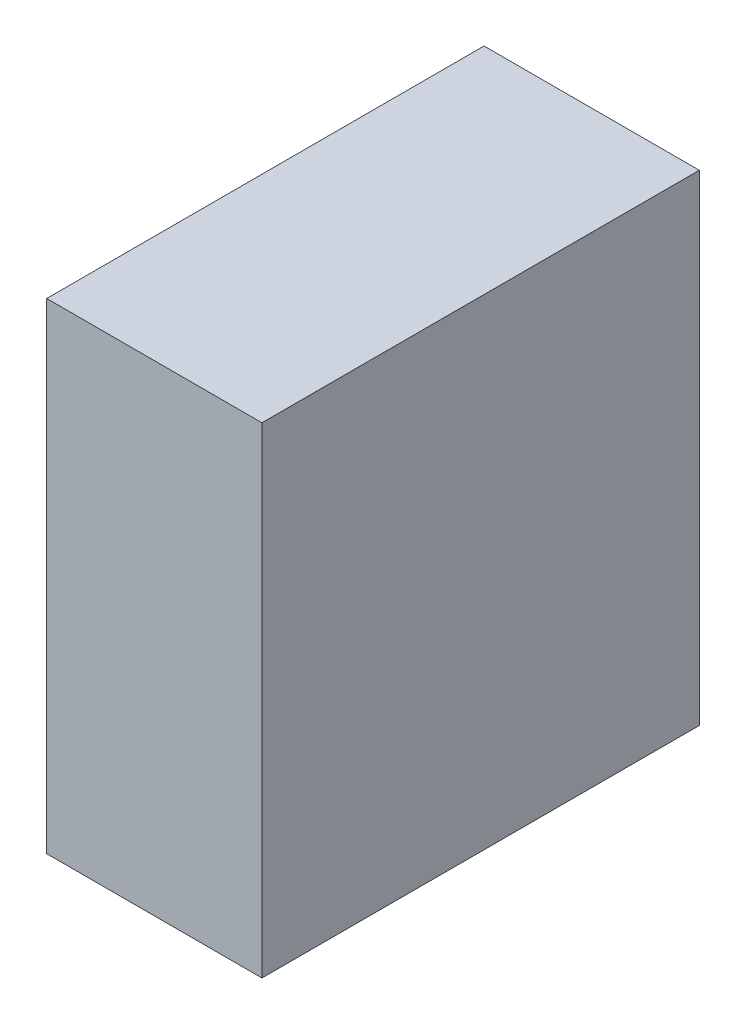
ISO-10303-21;
HEADER;
FILE_DESCRIPTION(('STEP AP214'),'2;1');
FILE_NAME('part.step','',(''),(''),'','','');
FILE_SCHEMA(('AUTOMOTIVE_DESIGN { 1 0 10303 214 1 1 1 1 }'));
ENDSEC;
DATA;
#1=APPLICATION_CONTEXT('core data for automotive mechanical design processes');
#2=APPLICATION_PROTOCOL_DEFINITION('international standard','automotive_design',2000,#1);
#3=PRODUCT_CONTEXT('',#1,'mechanical');
#4=PRODUCT('Part','Part','',(#3));
#5=PRODUCT_RELATED_PRODUCT_CATEGORY('part','',(#4));
#6=PRODUCT_DEFINITION_FORMATION('','',#4);
#7=PRODUCT_DEFINITION_CONTEXT('part definition',#1,'design');
#8=PRODUCT_DEFINITION('design','',#6,#7);
#9=PRODUCT_DEFINITION_SHAPE('','',#8);
#10=(LENGTH_UNIT() NAMED_UNIT(*) SI_UNIT(.MILLI.,.METRE.));
#11=(NAMED_UNIT(*) PLANE_ANGLE_UNIT() SI_UNIT($,.RADIAN.));
#12=(NAMED_UNIT(*) SI_UNIT($,.STERADIAN.) SOLID_ANGLE_UNIT());
#13=UNCERTAINTY_MEASURE_WITH_UNIT(LENGTH_MEASURE(1.E-05),#10,'distance_accuracy_value','');
#14=(GEOMETRIC_REPRESENTATION_CONTEXT(3) GLOBAL_UNCERTAINTY_ASSIGNED_CONTEXT((#13)) GLOBAL_UNIT_ASSIGNED_CONTEXT((#10,
#11,#12)) REPRESENTATION_CONTEXT('',''));
#15=CARTESIAN_POINT('',(0.,0.,0.));
#16=DIRECTION('',(0.,0.,1.));
#17=DIRECTION('',(1.,0.,0.));
#18=AXIS2_PLACEMENT_3D('',#15,#16,#17);
#19=CARTESIAN_POINT('',(-2.35000038,-5.2500022,0.));
#20=DIRECTION('',(-1.,0.,0.));
#21=DIRECTION('',(0.,0.,1.));
#22=AXIS2_PLACEMENT_3D('',#19,#20,#21);
#23=PLANE('',#22);
#24=DIRECTION('',(0.,0.,1.));
#25=VECTOR('',#24,1.);
#26=CARTESIAN_POINT('',(-2.35000038,5.2500022,0.));
#27=LINE('',#26,#25);
#28=CARTESIAN_POINT('',(-2.35000038,5.2500022,0.));
#29=VERTEX_POINT('',#28);
#30=CARTESIAN_POINT('',(-2.35000038,5.2500022,9.54999868));
#31=VERTEX_POINT('',#30);
#32=EDGE_CURVE('E20',#29,#31,#27,.T.);
#33=ORIENTED_EDGE('',*,*,#32,.F.);
#34=DIRECTION('',(0.,1.,0.));
#35=VECTOR('',#34,1.);
#36=CARTESIAN_POINT('',(-2.35000038,5.2500022,0.));
#37=LINE('',#36,#35);
#38=CARTESIAN_POINT('',(-2.35000038,-5.2500022,0.));
#39=VERTEX_POINT('',#38);
#40=EDGE_CURVE('E79',#29,#39,#37,.F.);
#41=ORIENTED_EDGE('',*,*,#40,.T.);
#42=DIRECTION('',(0.,0.,-1.));
#43=VECTOR('',#42,1.);
#44=CARTESIAN_POINT('',(-2.35000038,-5.2500022,0.));
#45=LINE('',#44,#43);
#46=CARTESIAN_POINT('',(-2.35000038,-5.2500022,9.54999868));
#47=VERTEX_POINT('',#46);
#48=EDGE_CURVE('E61',#47,#39,#45,.T.);
#49=ORIENTED_EDGE('',*,*,#48,.F.);
#50=DIRECTION('',(0.,1.,0.));
#51=VECTOR('',#50,1.);
#52=CARTESIAN_POINT('',(-2.35000038,5.2500022,9.54999868));
#53=LINE('',#52,#51);
#54=EDGE_CURVE('E56',#31,#47,#53,.F.);
#55=ORIENTED_EDGE('',*,*,#54,.F.);
#56=EDGE_LOOP('',(#33,#41,#49,#55));
#57=FACE_BOUND('',#56,.T.);
#58=ADVANCED_FACE('F17',(#57),#23,.T.);
#59=CARTESIAN_POINT('',(-2.35000038,5.2500022,0.));
#60=DIRECTION('',(0.,1.,0.));
#61=DIRECTION('',(0.,0.,1.));
#62=AXIS2_PLACEMENT_3D('',#59,#60,#61);
#63=PLANE('',#62);
#64=DIRECTION('',(0.,0.,-1.));
#65=VECTOR('',#64,1.);
#66=CARTESIAN_POINT('',(2.35000038,5.2500022,0.));
#67=LINE('',#66,#65);
#68=CARTESIAN_POINT('',(2.35000038,5.2500022,0.));
#69=VERTEX_POINT('',#68);
#70=CARTESIAN_POINT('',(2.35000038,5.2500022,9.54999868));
#71=VERTEX_POINT('',#70);
#72=EDGE_CURVE('E83',#69,#71,#67,.F.);
#73=ORIENTED_EDGE('',*,*,#72,.F.);
#74=DIRECTION('',(1.,0.,0.));
#75=VECTOR('',#74,1.);
#76=CARTESIAN_POINT('',(-2.35000038,5.2500022,0.));
#77=LINE('',#76,#75);
#78=EDGE_CURVE('E68',#69,#29,#77,.F.);
#79=ORIENTED_EDGE('',*,*,#78,.T.);
#80=ORIENTED_EDGE('',*,*,#32,.T.);
#81=DIRECTION('',(1.,0.,0.));
#82=VECTOR('',#81,1.);
#83=CARTESIAN_POINT('',(-2.35000038,5.2500022,9.54999868));
#84=LINE('',#83,#82);
#85=EDGE_CURVE('E63',#71,#31,#84,.F.);
#86=ORIENTED_EDGE('',*,*,#85,.F.);
#87=EDGE_LOOP('',(#73,#79,#80,#86));
#88=FACE_BOUND('',#87,.T.);
#89=ADVANCED_FACE('F65',(#88),#63,.T.);
#90=CARTESIAN_POINT('',(-2.35000038,5.2500022,9.54999868));
#91=DIRECTION('',(0.,0.,1.));
#92=DIRECTION('',(1.,0.,0.));
#93=AXIS2_PLACEMENT_3D('',#90,#91,#92);
#94=PLANE('',#93);
#95=DIRECTION('',(0.,1.,0.));
#96=VECTOR('',#95,1.);
#97=CARTESIAN_POINT('',(2.35000038,5.2500022,9.54999868));
#98=LINE('',#97,#96);
#99=CARTESIAN_POINT('',(2.35000038,-5.2500022,9.54999868));
#100=VERTEX_POINT('',#99);
#101=EDGE_CURVE('E72',#71,#100,#98,.F.);
#102=ORIENTED_EDGE('',*,*,#101,.F.);
#103=ORIENTED_EDGE('',*,*,#85,.T.);
#104=ORIENTED_EDGE('',*,*,#54,.T.);
#105=DIRECTION('',(1.,0.,0.));
#106=VECTOR('',#105,1.);
#107=CARTESIAN_POINT('',(2.35000038,-5.2500022,9.54999868));
#108=LINE('',#107,#106);
#109=EDGE_CURVE('E74',#100,#47,#108,.F.);
#110=ORIENTED_EDGE('',*,*,#109,.F.);
#111=EDGE_LOOP('',(#102,#103,#104,#110));
#112=FACE_BOUND('',#111,.T.);
#113=ADVANCED_FACE('F70',(#112),#94,.T.);
#114=CARTESIAN_POINT('',(2.35000038,-5.2500022,0.));
#115=DIRECTION('',(0.,-1.,0.));
#116=DIRECTION('',(0.,0.,-1.));
#117=AXIS2_PLACEMENT_3D('',#114,#115,#116);
#118=PLANE('',#117);
#119=ORIENTED_EDGE('',*,*,#48,.T.);
#120=DIRECTION('',(1.,0.,0.));
#121=VECTOR('',#120,1.);
#122=CARTESIAN_POINT('',(-2.35000038,-5.2500022,0.));
#123=LINE('',#122,#121);
#124=CARTESIAN_POINT('',(2.35000038,-5.2500022,0.));
#125=VERTEX_POINT('',#124);
#126=EDGE_CURVE('E35',#39,#125,#123,.T.);
#127=ORIENTED_EDGE('',*,*,#126,.T.);
#128=DIRECTION('',(0.,0.,-1.));
#129=VECTOR('',#128,1.);
#130=CARTESIAN_POINT('',(2.35000038,-5.2500022,0.));
#131=LINE('',#130,#129);
#132=EDGE_CURVE('E26',#100,#125,#131,.T.);
#133=ORIENTED_EDGE('',*,*,#132,.F.);
#134=ORIENTED_EDGE('',*,*,#109,.T.);
#135=EDGE_LOOP('',(#119,#127,#133,#134));
#136=FACE_BOUND('',#135,.T.);
#137=ADVANCED_FACE('F89',(#136),#118,.T.);
#138=CARTESIAN_POINT('',(-2.35000038,5.2500022,0.));
#139=DIRECTION('',(0.,0.,1.));
#140=DIRECTION('',(1.,0.,0.));
#141=AXIS2_PLACEMENT_3D('',#138,#139,#140);
#142=PLANE('',#141);
#143=DIRECTION('',(0.,1.,0.));
#144=VECTOR('',#143,1.);
#145=CARTESIAN_POINT('',(2.35000038,5.2500022,0.));
#146=LINE('',#145,#144);
#147=EDGE_CURVE('E11',#125,#69,#146,.T.);
#148=ORIENTED_EDGE('',*,*,#147,.F.);
#149=ORIENTED_EDGE('',*,*,#126,.F.);
#150=ORIENTED_EDGE('',*,*,#40,.F.);
#151=ORIENTED_EDGE('',*,*,#78,.F.);
#152=EDGE_LOOP('',(#148,#149,#150,#151));
#153=FACE_BOUND('',#152,.T.);
#154=ADVANCED_FACE('F91',(#153),#142,.F.);
#155=CARTESIAN_POINT('',(2.35000038,5.2500022,0.));
#156=DIRECTION('',(1.,0.,0.));
#157=DIRECTION('',(0.,0.,-1.));
#158=AXIS2_PLACEMENT_3D('',#155,#156,#157);
#159=PLANE('',#158);
#160=ORIENTED_EDGE('',*,*,#132,.T.);
#161=ORIENTED_EDGE('',*,*,#147,.T.);
#162=ORIENTED_EDGE('',*,*,#72,.T.);
#163=ORIENTED_EDGE('',*,*,#101,.T.);
#164=EDGE_LOOP('',(#160,#161,#162,#163));
#165=FACE_BOUND('',#164,.T.);
#166=ADVANCED_FACE('F88',(#165),#159,.T.);
#167=CLOSED_SHELL('',(#58,#89,#113,#137,#154,#166));
#168=MANIFOLD_SOLID_BREP('B1',#167);
#169=ADVANCED_BREP_SHAPE_REPRESENTATION('',(#18,#168),#14);
#170=SHAPE_DEFINITION_REPRESENTATION(#9,#169);
ENDSEC;
END-ISO-10303-21;
